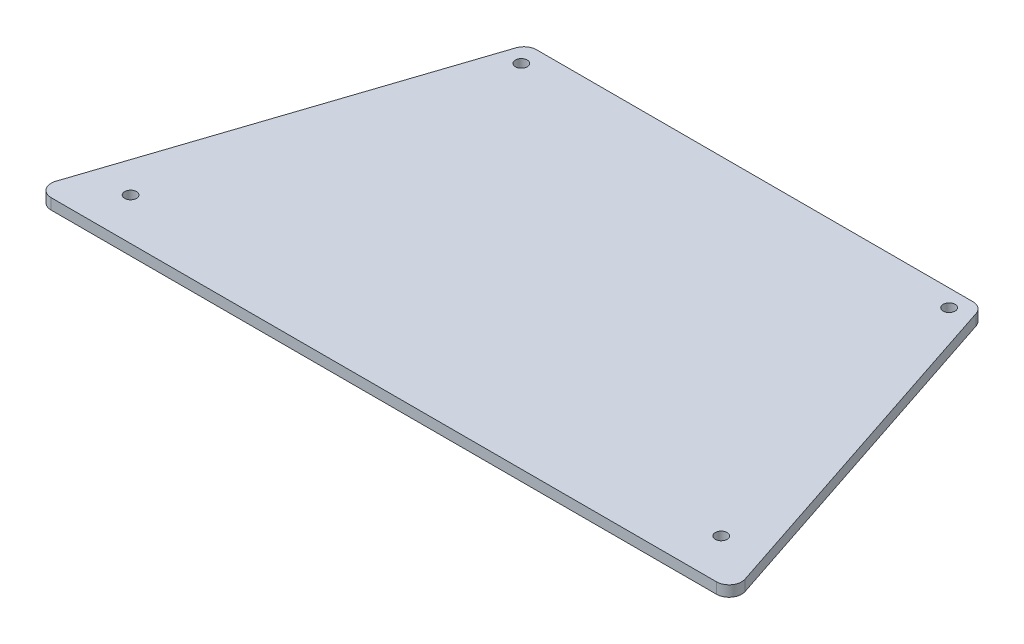
ISO-10303-21;
HEADER;
FILE_DESCRIPTION(('STEP AP214'),'2;1');
FILE_NAME('part.step','',(''),(''),'','','');
FILE_SCHEMA(('AUTOMOTIVE_DESIGN { 1 0 10303 214 1 1 1 1 }'));
ENDSEC;
DATA;
#1=APPLICATION_CONTEXT('core data for automotive mechanical design processes');
#2=APPLICATION_PROTOCOL_DEFINITION('international standard','automotive_design',2000,#1);
#3=PRODUCT_CONTEXT('',#1,'mechanical');
#4=PRODUCT('Part','Part','',(#3));
#5=PRODUCT_RELATED_PRODUCT_CATEGORY('part','',(#4));
#6=PRODUCT_DEFINITION_FORMATION('','',#4);
#7=PRODUCT_DEFINITION_CONTEXT('part definition',#1,'design');
#8=PRODUCT_DEFINITION('design','',#6,#7);
#9=PRODUCT_DEFINITION_SHAPE('','',#8);
#10=(LENGTH_UNIT() NAMED_UNIT(*) SI_UNIT(.MILLI.,.METRE.));
#11=(NAMED_UNIT(*) PLANE_ANGLE_UNIT() SI_UNIT($,.RADIAN.));
#12=(NAMED_UNIT(*) SI_UNIT($,.STERADIAN.) SOLID_ANGLE_UNIT());
#13=UNCERTAINTY_MEASURE_WITH_UNIT(LENGTH_MEASURE(1.E-05),#10,'distance_accuracy_value','');
#14=(GEOMETRIC_REPRESENTATION_CONTEXT(3) GLOBAL_UNCERTAINTY_ASSIGNED_CONTEXT((#13)) GLOBAL_UNIT_ASSIGNED_CONTEXT((#10,
#11,#12)) REPRESENTATION_CONTEXT('',''));
#15=CARTESIAN_POINT('',(0.,0.,0.));
#16=DIRECTION('',(0.,0.,1.));
#17=DIRECTION('',(1.,0.,0.));
#18=AXIS2_PLACEMENT_3D('',#15,#16,#17);
#19=CARTESIAN_POINT('',(-60.57,-3.,-99.9774664960479));
#20=DIRECTION('',(0.,1.,0.));
#21=DIRECTION('',(0.,0.,1.));
#22=AXIS2_PLACEMENT_3D('',#19,#20,#21);
#23=CYLINDRICAL_SURFACE('',#22,3.5);
#24=CARTESIAN_POINT('',(-60.57,0.,-99.9774664960479));
#25=DIRECTION('',(0.,1.,0.));
#26=DIRECTION('',(0.,0.,1.));
#27=AXIS2_PLACEMENT_3D('',#24,#25,#26);
#28=CIRCLE('',#27,3.5);
#29=CARTESIAN_POINT('',(-60.57,0.,-103.477466496048));
#30=VERTEX_POINT('',#29);
#31=CARTESIAN_POINT('',(-63.8923334263294,0.,-101.07842090214));
#32=VERTEX_POINT('',#31);
#33=EDGE_CURVE('E138',#30,#32,#28,.T.);
#34=ORIENTED_EDGE('',*,*,#33,.F.);
#35=DIRECTION('',(0.,1.,0.));
#36=VECTOR('',#35,1.);
#37=CARTESIAN_POINT('',(-60.57,-3.,-103.477466496048));
#38=LINE('',#37,#36);
#39=CARTESIAN_POINT('',(-60.57,-3.,-103.477466496048));
#40=VERTEX_POINT('',#39);
#41=EDGE_CURVE('E11',#40,#30,#38,.T.);
#42=ORIENTED_EDGE('',*,*,#41,.F.);
#43=CARTESIAN_POINT('',(-60.57,-3.,-99.9774664960479));
#44=DIRECTION('',(0.,1.,0.));
#45=DIRECTION('',(0.,0.,1.));
#46=AXIS2_PLACEMENT_3D('',#43,#44,#45);
#47=CIRCLE('',#46,3.5);
#48=CARTESIAN_POINT('',(-63.8923334263294,-3.,-101.07842090214));
#49=VERTEX_POINT('',#48);
#50=EDGE_CURVE('E159',#40,#49,#47,.T.);
#51=ORIENTED_EDGE('',*,*,#50,.T.);
#52=DIRECTION('',(0.,1.,0.));
#53=VECTOR('',#52,1.);
#54=CARTESIAN_POINT('',(-63.8923334263294,-3.,-101.07842090214));
#55=LINE('',#54,#53);
#56=EDGE_CURVE('E44',#49,#32,#55,.T.);
#57=ORIENTED_EDGE('',*,*,#56,.T.);
#58=EDGE_LOOP('',(#34,#42,#51,#57));
#59=FACE_BOUND('',#58,.T.);
#60=ADVANCED_FACE('F40',(#59),#23,.T.);
#61=CARTESIAN_POINT('',(60.57,-3.,-103.477466496048));
#62=DIRECTION('',(0.,0.,-1.));
#63=DIRECTION('',(-1.,0.,0.));
#64=AXIS2_PLACEMENT_3D('',#61,#62,#63);
#65=PLANE('',#64);
#66=DIRECTION('',(-1.,0.,0.));
#67=VECTOR('',#66,1.);
#68=CARTESIAN_POINT('',(60.57,0.,-103.477466496048));
#69=LINE('',#68,#67);
#70=CARTESIAN_POINT('',(60.57,0.,-103.477466496048));
#71=VERTEX_POINT('',#70);
#72=EDGE_CURVE('E157',#71,#30,#69,.T.);
#73=ORIENTED_EDGE('',*,*,#72,.F.);
#74=DIRECTION('',(0.,1.,0.));
#75=VECTOR('',#74,1.);
#76=CARTESIAN_POINT('',(60.57,-3.,-103.477466496048));
#77=LINE('',#76,#75);
#78=CARTESIAN_POINT('',(60.57,-3.,-103.477466496048));
#79=VERTEX_POINT('',#78);
#80=EDGE_CURVE('E50',#79,#71,#77,.T.);
#81=ORIENTED_EDGE('',*,*,#80,.F.);
#82=DIRECTION('',(-1.,0.,0.));
#83=VECTOR('',#82,1.);
#84=CARTESIAN_POINT('',(60.57,-3.,-103.477466496048));
#85=LINE('',#84,#83);
#86=EDGE_CURVE('E128',#79,#40,#85,.T.);
#87=ORIENTED_EDGE('',*,*,#86,.T.);
#88=ORIENTED_EDGE('',*,*,#41,.T.);
#89=EDGE_LOOP('',(#73,#81,#87,#88));
#90=FACE_BOUND('',#89,.T.);
#91=ADVANCED_FACE('F171',(#90),#65,.T.);
#92=CARTESIAN_POINT('',(60.57,-3.,-99.9774664960479));
#93=DIRECTION('',(0.,1.,0.));
#94=DIRECTION('',(0.,0.,1.));
#95=AXIS2_PLACEMENT_3D('',#92,#93,#94);
#96=CYLINDRICAL_SURFACE('',#95,3.5);
#97=CARTESIAN_POINT('',(60.57,0.,-99.9774664960479));
#98=DIRECTION('',(0.,1.,0.));
#99=DIRECTION('',(0.,0.,1.));
#100=AXIS2_PLACEMENT_3D('',#97,#98,#99);
#101=CIRCLE('',#100,3.5);
#102=CARTESIAN_POINT('',(63.8923334263294,0.,-101.07842090214));
#103=VERTEX_POINT('',#102);
#104=EDGE_CURVE('E115',#103,#71,#101,.T.);
#105=ORIENTED_EDGE('',*,*,#104,.F.);
#106=DIRECTION('',(0.,1.,0.));
#107=VECTOR('',#106,1.);
#108=CARTESIAN_POINT('',(63.8923334263294,-3.,-101.07842090214));
#109=LINE('',#108,#107);
#110=CARTESIAN_POINT('',(63.8923334263294,-3.,-101.07842090214));
#111=VERTEX_POINT('',#110);
#112=EDGE_CURVE('E110',#111,#103,#109,.T.);
#113=ORIENTED_EDGE('',*,*,#112,.F.);
#114=CARTESIAN_POINT('',(60.57,-3.,-99.9774664960479));
#115=DIRECTION('',(0.,1.,0.));
#116=DIRECTION('',(0.,0.,1.));
#117=AXIS2_PLACEMENT_3D('',#114,#115,#116);
#118=CIRCLE('',#117,3.5);
#119=EDGE_CURVE('E113',#111,#79,#118,.T.);
#120=ORIENTED_EDGE('',*,*,#119,.T.);
#121=ORIENTED_EDGE('',*,*,#80,.T.);
#122=EDGE_LOOP('',(#105,#113,#120,#121));
#123=FACE_BOUND('',#122,.T.);
#124=ADVANCED_FACE('F112',(#123),#96,.T.);
#125=CARTESIAN_POINT('',(95.6973334263294,-3.,-5.10095440609244));
#126=DIRECTION('',(0.949238121808406,0.,-0.314558401740679));
#127=DIRECTION('',(-0.314558401740679,0.,-0.949238121808406));
#128=AXIS2_PLACEMENT_3D('',#125,#126,#127);
#129=PLANE('',#128);
#130=DIRECTION('',(-0.314558401740679,0.,-0.949238121808406));
#131=VECTOR('',#130,1.);
#132=CARTESIAN_POINT('',(95.6973334263294,0.,-5.10095440609244));
#133=LINE('',#132,#131);
#134=CARTESIAN_POINT('',(95.6973334263294,0.,-5.10095440609244));
#135=VERTEX_POINT('',#134);
#136=EDGE_CURVE('E154',#135,#103,#133,.T.);
#137=ORIENTED_EDGE('',*,*,#136,.F.);
#138=DIRECTION('',(0.,1.,0.));
#139=VECTOR('',#138,1.);
#140=CARTESIAN_POINT('',(95.6973334263294,-3.,-5.10095440609244));
#141=LINE('',#140,#139);
#142=CARTESIAN_POINT('',(95.6973334263294,-3.,-5.10095440609244));
#143=VERTEX_POINT('',#142);
#144=EDGE_CURVE('E120',#143,#135,#141,.T.);
#145=ORIENTED_EDGE('',*,*,#144,.F.);
#146=DIRECTION('',(-0.314558401740679,0.,-0.949238121808406));
#147=VECTOR('',#146,1.);
#148=CARTESIAN_POINT('',(95.6973334263294,-3.,-5.10095440609244));
#149=LINE('',#148,#147);
#150=EDGE_CURVE('E126',#143,#111,#149,.T.);
#151=ORIENTED_EDGE('',*,*,#150,.T.);
#152=ORIENTED_EDGE('',*,*,#112,.T.);
#153=EDGE_LOOP('',(#137,#145,#151,#152));
#154=FACE_BOUND('',#153,.T.);
#155=ADVANCED_FACE('F130',(#154),#129,.T.);
#156=CARTESIAN_POINT('',(92.375,-3.,-4.00000000000002));
#157=DIRECTION('',(0.,1.,0.));
#158=DIRECTION('',(0.,0.,1.));
#159=AXIS2_PLACEMENT_3D('',#156,#157,#158);
#160=CYLINDRICAL_SURFACE('',#159,3.50000000000002);
#161=CARTESIAN_POINT('',(92.375,0.,-4.00000000000002));
#162=DIRECTION('',(0.,1.,0.));
#163=DIRECTION('',(0.,0.,1.));
#164=AXIS2_PLACEMENT_3D('',#161,#162,#163);
#165=CIRCLE('',#164,3.50000000000002);
#166=CARTESIAN_POINT('',(92.375,0.,-0.5));
#167=VERTEX_POINT('',#166);
#168=EDGE_CURVE('E151',#167,#135,#165,.T.);
#169=ORIENTED_EDGE('',*,*,#168,.F.);
#170=DIRECTION('',(0.,1.,0.));
#171=VECTOR('',#170,1.);
#172=CARTESIAN_POINT('',(92.375,-3.,-0.5));
#173=LINE('',#172,#171);
#174=CARTESIAN_POINT('',(92.375,-3.,-0.5));
#175=VERTEX_POINT('',#174);
#176=EDGE_CURVE('E163',#175,#167,#173,.T.);
#177=ORIENTED_EDGE('',*,*,#176,.F.);
#178=CARTESIAN_POINT('',(92.375,-3.,-4.00000000000002));
#179=DIRECTION('',(0.,1.,0.));
#180=DIRECTION('',(0.,0.,1.));
#181=AXIS2_PLACEMENT_3D('',#178,#179,#180);
#182=CIRCLE('',#181,3.50000000000002);
#183=EDGE_CURVE('E131',#175,#143,#182,.T.);
#184=ORIENTED_EDGE('',*,*,#183,.T.);
#185=ORIENTED_EDGE('',*,*,#144,.T.);
#186=EDGE_LOOP('',(#169,#177,#184,#185));
#187=FACE_BOUND('',#186,.T.);
#188=ADVANCED_FACE('F184',(#187),#160,.T.);
#189=CARTESIAN_POINT('',(-92.375,-3.,-0.500000000000014));
#190=DIRECTION('',(0.,0.,1.));
#191=DIRECTION('',(1.,0.,0.));
#192=AXIS2_PLACEMENT_3D('',#189,#190,#191);
#193=PLANE('',#192);
#194=DIRECTION('',(1.,0.,0.));
#195=VECTOR('',#194,1.);
#196=CARTESIAN_POINT('',(-92.375,0.,-0.500000000000014));
#197=LINE('',#196,#195);
#198=CARTESIAN_POINT('',(-92.375,0.,-0.500000000000014));
#199=VERTEX_POINT('',#198);
#200=EDGE_CURVE('E148',#199,#167,#197,.T.);
#201=ORIENTED_EDGE('',*,*,#200,.F.);
#202=DIRECTION('',(0.,1.,0.));
#203=VECTOR('',#202,1.);
#204=CARTESIAN_POINT('',(-92.375,-3.,-0.500000000000014));
#205=LINE('',#204,#203);
#206=CARTESIAN_POINT('',(-92.375,-3.,-0.500000000000014));
#207=VERTEX_POINT('',#206);
#208=EDGE_CURVE('E165',#207,#199,#205,.T.);
#209=ORIENTED_EDGE('',*,*,#208,.F.);
#210=DIRECTION('',(1.,0.,0.));
#211=VECTOR('',#210,1.);
#212=CARTESIAN_POINT('',(-92.375,-3.,-0.500000000000014));
#213=LINE('',#212,#211);
#214=EDGE_CURVE('E133',#207,#175,#213,.T.);
#215=ORIENTED_EDGE('',*,*,#214,.T.);
#216=ORIENTED_EDGE('',*,*,#176,.T.);
#217=EDGE_LOOP('',(#201,#209,#215,#216));
#218=FACE_BOUND('',#217,.T.);
#219=ADVANCED_FACE('F187',(#218),#193,.T.);
#220=CARTESIAN_POINT('',(-92.375,-3.,-4.00000000000002));
#221=DIRECTION('',(0.,1.,0.));
#222=DIRECTION('',(0.,0.,1.));
#223=AXIS2_PLACEMENT_3D('',#220,#221,#222);
#224=CYLINDRICAL_SURFACE('',#223,3.5);
#225=CARTESIAN_POINT('',(-92.375,0.,-4.00000000000002));
#226=DIRECTION('',(0.,-1.,0.));
#227=DIRECTION('',(0.,0.,-1.));
#228=AXIS2_PLACEMENT_3D('',#225,#226,#227);
#229=CIRCLE('',#228,3.5);
#230=CARTESIAN_POINT('',(-95.6973334263294,0.,-5.10095440609239));
#231=VERTEX_POINT('',#230);
#232=EDGE_CURVE('E145',#199,#231,#229,.T.);
#233=ORIENTED_EDGE('',*,*,#232,.T.);
#234=DIRECTION('',(0.,1.,0.));
#235=VECTOR('',#234,1.);
#236=CARTESIAN_POINT('',(-95.6973334263294,-3.,-5.10095440609239));
#237=LINE('',#236,#235);
#238=CARTESIAN_POINT('',(-95.6973334263294,-3.,-5.10095440609239));
#239=VERTEX_POINT('',#238);
#240=EDGE_CURVE('E166',#239,#231,#237,.T.);
#241=ORIENTED_EDGE('',*,*,#240,.F.);
#242=CARTESIAN_POINT('',(-92.375,-3.,-4.00000000000002));
#243=DIRECTION('',(0.,-1.,0.));
#244=DIRECTION('',(0.,0.,-1.));
#245=AXIS2_PLACEMENT_3D('',#242,#243,#244);
#246=CIRCLE('',#245,3.5);
#247=EDGE_CURVE('E234',#207,#239,#246,.T.);
#248=ORIENTED_EDGE('',*,*,#247,.F.);
#249=ORIENTED_EDGE('',*,*,#208,.T.);
#250=EDGE_LOOP('',(#233,#241,#248,#249));
#251=FACE_BOUND('',#250,.T.);
#252=ADVANCED_FACE('F191',(#251),#224,.T.);
#253=CARTESIAN_POINT('',(-63.8923334263294,-3.,-101.07842090214));
#254=DIRECTION('',(-0.949238121808406,0.,-0.314558401740678));
#255=DIRECTION('',(-0.314558401740678,0.,0.949238121808406));
#256=AXIS2_PLACEMENT_3D('',#253,#254,#255);
#257=PLANE('',#256);
#258=DIRECTION('',(-0.314558401740678,0.,0.949238121808406));
#259=VECTOR('',#258,1.);
#260=CARTESIAN_POINT('',(-63.8923334263294,0.,-101.07842090214));
#261=LINE('',#260,#259);
#262=EDGE_CURVE('E141',#32,#231,#261,.T.);
#263=ORIENTED_EDGE('',*,*,#262,.F.);
#264=ORIENTED_EDGE('',*,*,#56,.F.);
#265=DIRECTION('',(-0.314558401740678,0.,0.949238121808406));
#266=VECTOR('',#265,1.);
#267=CARTESIAN_POINT('',(-63.8923334263294,-3.,-101.07842090214));
#268=LINE('',#267,#266);
#269=EDGE_CURVE('E232',#49,#239,#268,.T.);
#270=ORIENTED_EDGE('',*,*,#269,.T.);
#271=ORIENTED_EDGE('',*,*,#240,.T.);
#272=EDGE_LOOP('',(#263,#264,#270,#271));
#273=FACE_BOUND('',#272,.T.);
#274=ADVANCED_FACE('F168',(#273),#257,.T.);
#275=CARTESIAN_POINT('',(-60.57,-3.,-99.9774664960479));
#276=DIRECTION('',(0.,1.,0.));
#277=DIRECTION('',(0.,0.,1.));
#278=AXIS2_PLACEMENT_3D('',#275,#276,#277);
#279=PLANE('',#278);
#280=CARTESIAN_POINT('',(-81.9999999999146,-3.,-12.1824164647822));
#281=DIRECTION('',(0.,-1.,0.));
#282=DIRECTION('',(0.,0.,-1.));
#283=AXIS2_PLACEMENT_3D('',#280,#281,#282);
#284=CIRCLE('',#283,1.64999999998227);
#285=CARTESIAN_POINT('',(-81.9999999999146,-3.,-13.8324164647645));
#286=VERTEX_POINT('',#285);
#287=EDGE_CURVE('E209',#286,#286,#284,.T.);
#288=ORIENTED_EDGE('',*,*,#287,.F.);
#289=EDGE_LOOP('',(#288));
#290=FACE_BOUND('',#289,.T.);
#291=CARTESIAN_POINT('',(82.0000000000854,-3.,-12.1824164647813));
#292=DIRECTION('',(0.,-1.,0.));
#293=DIRECTION('',(0.,0.,-1.));
#294=AXIS2_PLACEMENT_3D('',#291,#292,#293);
#295=CIRCLE('',#294,1.64999999998227);
#296=CARTESIAN_POINT('',(82.0000000000854,-3.,-13.8324164647636));
#297=VERTEX_POINT('',#296);
#298=EDGE_CURVE('E213',#297,#297,#295,.T.);
#299=ORIENTED_EDGE('',*,*,#298,.F.);
#300=EDGE_LOOP('',(#299));
#301=FACE_BOUND('',#300,.T.);
#302=CARTESIAN_POINT('',(58.7577979890137,-3.,-98.7198017724881));
#303=DIRECTION('',(0.,-1.,0.));
#304=DIRECTION('',(0.,0.,-1.));
#305=AXIS2_PLACEMENT_3D('',#302,#303,#304);
#306=CIRCLE('',#305,1.64999999998228);
#307=CARTESIAN_POINT('',(58.7577979890137,-3.,-100.36980177247));
#308=VERTEX_POINT('',#307);
#309=EDGE_CURVE('E217',#308,#308,#306,.T.);
#310=ORIENTED_EDGE('',*,*,#309,.F.);
#311=EDGE_LOOP('',(#310));
#312=FACE_BOUND('',#311,.T.);
#313=CARTESIAN_POINT('',(-59.3927137289491,-3.,-98.076633575267));
#314=DIRECTION('',(0.,-1.,0.));
#315=DIRECTION('',(0.,0.,-1.));
#316=AXIS2_PLACEMENT_3D('',#313,#314,#315);
#317=CIRCLE('',#316,1.64999999998227);
#318=CARTESIAN_POINT('',(-59.3927137289491,-3.,-99.7266335752493));
#319=VERTEX_POINT('',#318);
#320=EDGE_CURVE('E220',#319,#319,#317,.T.);
#321=ORIENTED_EDGE('',*,*,#320,.F.);
#322=EDGE_LOOP('',(#321));
#323=FACE_BOUND('',#322,.T.);
#324=ORIENTED_EDGE('',*,*,#50,.F.);
#325=ORIENTED_EDGE('',*,*,#86,.F.);
#326=ORIENTED_EDGE('',*,*,#119,.F.);
#327=ORIENTED_EDGE('',*,*,#150,.F.);
#328=ORIENTED_EDGE('',*,*,#183,.F.);
#329=ORIENTED_EDGE('',*,*,#214,.F.);
#330=ORIENTED_EDGE('',*,*,#247,.T.);
#331=ORIENTED_EDGE('',*,*,#269,.F.);
#332=EDGE_LOOP('',(#324,#325,#326,#327,#328,#329,#330,#331));
#333=FACE_BOUND('',#332,.T.);
#334=ADVANCED_FACE('F124',(#290,#301,#312,#323,#333),#279,.F.);
#335=CARTESIAN_POINT('',(-60.57,0.,-99.9774664960479));
#336=DIRECTION('',(0.,1.,0.));
#337=DIRECTION('',(0.,0.,1.));
#338=AXIS2_PLACEMENT_3D('',#335,#336,#337);
#339=PLANE('',#338);
#340=CARTESIAN_POINT('',(-81.9999999999146,0.,-12.1824164647822));
#341=DIRECTION('',(0.,1.,0.));
#342=DIRECTION('',(0.,0.,1.));
#343=AXIS2_PLACEMENT_3D('',#340,#341,#342);
#344=CIRCLE('',#343,1.64999999998227);
#345=CARTESIAN_POINT('',(-81.9999999999146,0.,-10.5324164647999));
#346=VERTEX_POINT('',#345);
#347=EDGE_CURVE('E142',#346,#346,#344,.F.);
#348=ORIENTED_EDGE('',*,*,#347,.T.);
#349=EDGE_LOOP('',(#348));
#350=FACE_BOUND('',#349,.T.);
#351=CARTESIAN_POINT('',(82.0000000000854,0.,-12.1824164647813));
#352=DIRECTION('',(0.,1.,0.));
#353=DIRECTION('',(0.,0.,1.));
#354=AXIS2_PLACEMENT_3D('',#351,#352,#353);
#355=CIRCLE('',#354,1.64999999998227);
#356=CARTESIAN_POINT('',(82.0000000000854,0.,-10.532416464799));
#357=VERTEX_POINT('',#356);
#358=EDGE_CURVE('E240',#357,#357,#355,.F.);
#359=ORIENTED_EDGE('',*,*,#358,.T.);
#360=EDGE_LOOP('',(#359));
#361=FACE_BOUND('',#360,.T.);
#362=CARTESIAN_POINT('',(58.7577979890137,0.,-98.7198017724881));
#363=DIRECTION('',(0.,1.,0.));
#364=DIRECTION('',(0.,0.,1.));
#365=AXIS2_PLACEMENT_3D('',#362,#363,#364);
#366=CIRCLE('',#365,1.64999999998228);
#367=CARTESIAN_POINT('',(58.7577979890137,0.,-97.0698017725059));
#368=VERTEX_POINT('',#367);
#369=EDGE_CURVE('E222',#368,#368,#366,.F.);
#370=ORIENTED_EDGE('',*,*,#369,.T.);
#371=EDGE_LOOP('',(#370));
#372=FACE_BOUND('',#371,.T.);
#373=CARTESIAN_POINT('',(-59.3927137289491,0.,-98.076633575267));
#374=DIRECTION('',(0.,1.,0.));
#375=DIRECTION('',(0.,0.,1.));
#376=AXIS2_PLACEMENT_3D('',#373,#374,#375);
#377=CIRCLE('',#376,1.64999999998227);
#378=CARTESIAN_POINT('',(-59.3927137289491,0.,-96.4266335752847));
#379=VERTEX_POINT('',#378);
#380=EDGE_CURVE('E223',#379,#379,#377,.F.);
#381=ORIENTED_EDGE('',*,*,#380,.T.);
#382=EDGE_LOOP('',(#381));
#383=FACE_BOUND('',#382,.T.);
#384=ORIENTED_EDGE('',*,*,#33,.T.);
#385=ORIENTED_EDGE('',*,*,#262,.T.);
#386=ORIENTED_EDGE('',*,*,#232,.F.);
#387=ORIENTED_EDGE('',*,*,#200,.T.);
#388=ORIENTED_EDGE('',*,*,#168,.T.);
#389=ORIENTED_EDGE('',*,*,#136,.T.);
#390=ORIENTED_EDGE('',*,*,#104,.T.);
#391=ORIENTED_EDGE('',*,*,#72,.T.);
#392=EDGE_LOOP('',(#384,#385,#386,#387,#388,#389,#390,#391));
#393=FACE_BOUND('',#392,.T.);
#394=ADVANCED_FACE('F42',(#350,#361,#372,#383,#393),#339,.T.);
#395=CARTESIAN_POINT('',(-59.3927137289491,4.66690475578108,-98.076633575267));
#396=DIRECTION('',(0.,-1.,0.));
#397=DIRECTION('',(0.,0.,-1.));
#398=AXIS2_PLACEMENT_3D('',#395,#396,#397);
#399=CYLINDRICAL_SURFACE('',#398,1.64999999998227);
#400=ORIENTED_EDGE('',*,*,#320,.T.);
#401=EDGE_LOOP('',(#400));
#402=FACE_BOUND('',#401,.T.);
#403=ORIENTED_EDGE('',*,*,#380,.F.);
#404=EDGE_LOOP('',(#403));
#405=FACE_BOUND('',#404,.T.);
#406=ADVANCED_FACE('F204',(#402,#405),#399,.F.);
#407=CARTESIAN_POINT('',(58.7577979890137,4.66690475578108,-98.7198017724881));
#408=DIRECTION('',(0.,-1.,0.));
#409=DIRECTION('',(0.,0.,-1.));
#410=AXIS2_PLACEMENT_3D('',#407,#408,#409);
#411=CYLINDRICAL_SURFACE('',#410,1.64999999998228);
#412=ORIENTED_EDGE('',*,*,#309,.T.);
#413=EDGE_LOOP('',(#412));
#414=FACE_BOUND('',#413,.T.);
#415=ORIENTED_EDGE('',*,*,#369,.F.);
#416=EDGE_LOOP('',(#415));
#417=FACE_BOUND('',#416,.T.);
#418=ADVANCED_FACE('F262',(#414,#417),#411,.F.);
#419=CARTESIAN_POINT('',(82.0000000000854,4.66690475578108,-12.1824164647813));
#420=DIRECTION('',(0.,-1.,0.));
#421=DIRECTION('',(0.,0.,-1.));
#422=AXIS2_PLACEMENT_3D('',#419,#420,#421);
#423=CYLINDRICAL_SURFACE('',#422,1.64999999998227);
#424=ORIENTED_EDGE('',*,*,#298,.T.);
#425=EDGE_LOOP('',(#424));
#426=FACE_BOUND('',#425,.T.);
#427=ORIENTED_EDGE('',*,*,#358,.F.);
#428=EDGE_LOOP('',(#427));
#429=FACE_BOUND('',#428,.T.);
#430=ADVANCED_FACE('F251',(#426,#429),#423,.F.);
#431=CARTESIAN_POINT('',(-81.9999999999146,4.66690475578108,-12.1824164647822));
#432=DIRECTION('',(0.,-1.,0.));
#433=DIRECTION('',(0.,0.,-1.));
#434=AXIS2_PLACEMENT_3D('',#431,#432,#433);
#435=CYLINDRICAL_SURFACE('',#434,1.64999999998227);
#436=ORIENTED_EDGE('',*,*,#287,.T.);
#437=EDGE_LOOP('',(#436));
#438=FACE_BOUND('',#437,.T.);
#439=ORIENTED_EDGE('',*,*,#347,.F.);
#440=EDGE_LOOP('',(#439));
#441=FACE_BOUND('',#440,.T.);
#442=ADVANCED_FACE('F248',(#438,#441),#435,.F.);
#443=CLOSED_SHELL('',(#60,#91,#124,#155,#188,#219,#252,#274,#334,#394,#406,#418,#430,#442));
#444=MANIFOLD_SOLID_BREP('B2',#443);
#445=ADVANCED_BREP_SHAPE_REPRESENTATION('',(#18,#444),#14);
#446=SHAPE_DEFINITION_REPRESENTATION(#9,#445);
ENDSEC;
END-ISO-10303-21;
